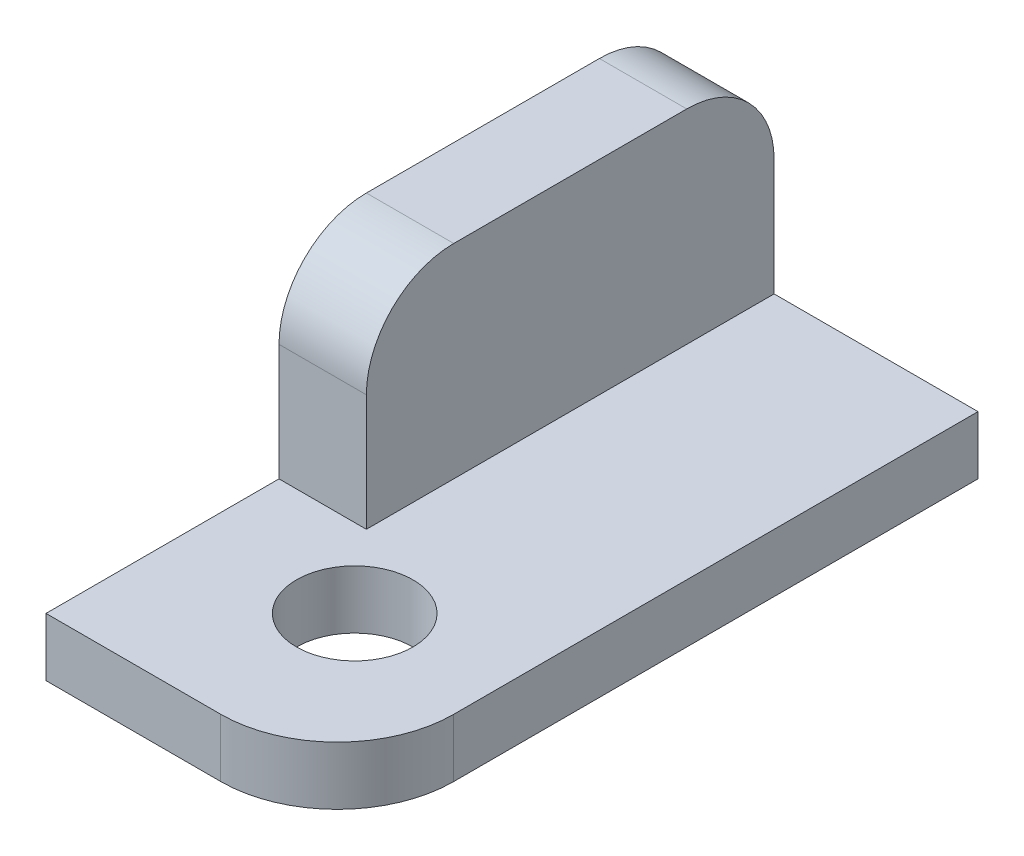
ISO-10303-21;
HEADER;
FILE_DESCRIPTION(('STEP AP214'),'2;1');
FILE_NAME('part.step','',(''),(''),'','','');
FILE_SCHEMA(('AUTOMOTIVE_DESIGN { 1 0 10303 214 1 1 1 1 }'));
ENDSEC;
DATA;
#1=APPLICATION_CONTEXT('core data for automotive mechanical design processes');
#2=APPLICATION_PROTOCOL_DEFINITION('international standard','automotive_design',2000,#1);
#3=PRODUCT_CONTEXT('',#1,'mechanical');
#4=PRODUCT('Part','Part','',(#3));
#5=PRODUCT_RELATED_PRODUCT_CATEGORY('part','',(#4));
#6=PRODUCT_DEFINITION_FORMATION('','',#4);
#7=PRODUCT_DEFINITION_CONTEXT('part definition',#1,'design');
#8=PRODUCT_DEFINITION('design','',#6,#7);
#9=PRODUCT_DEFINITION_SHAPE('','',#8);
#10=(LENGTH_UNIT() NAMED_UNIT(*) SI_UNIT(.MILLI.,.METRE.));
#11=(NAMED_UNIT(*) PLANE_ANGLE_UNIT() SI_UNIT($,.RADIAN.));
#12=(NAMED_UNIT(*) SI_UNIT($,.STERADIAN.) SOLID_ANGLE_UNIT());
#13=UNCERTAINTY_MEASURE_WITH_UNIT(LENGTH_MEASURE(1.E-05),#10,'distance_accuracy_value','');
#14=(GEOMETRIC_REPRESENTATION_CONTEXT(3) GLOBAL_UNCERTAINTY_ASSIGNED_CONTEXT((#13)) GLOBAL_UNIT_ASSIGNED_CONTEXT((#10,
#11,#12)) REPRESENTATION_CONTEXT('',''));
#15=CARTESIAN_POINT('',(0.,0.,0.));
#16=DIRECTION('',(0.,0.,1.));
#17=DIRECTION('',(1.,0.,0.));
#18=AXIS2_PLACEMENT_3D('',#15,#16,#17);
#19=CARTESIAN_POINT('',(50.,0.,0.));
#20=DIRECTION('',(0.,0.,-1.));
#21=DIRECTION('',(0.,1.,0.));
#22=AXIS2_PLACEMENT_3D('',#19,#20,#21);
#23=PLANE('',#22);
#24=DIRECTION('',(-1.,0.,0.));
#25=VECTOR('',#24,1.);
#26=CARTESIAN_POINT('',(50.,-10.,0.));
#27=LINE('',#26,#25);
#28=CARTESIAN_POINT('',(30.,-10.,0.));
#29=VERTEX_POINT('',#28);
#30=CARTESIAN_POINT('',(0.,-10.,0.));
#31=VERTEX_POINT('',#30);
#32=EDGE_CURVE('E140',#29,#31,#27,.T.);
#33=ORIENTED_EDGE('',*,*,#32,.F.);
#34=DIRECTION('',(0.,-1.,0.));
#35=VECTOR('',#34,1.);
#36=CARTESIAN_POINT('',(30.,0.,0.));
#37=LINE('',#36,#35);
#38=CARTESIAN_POINT('',(30.,0.,0.));
#39=VERTEX_POINT('',#38);
#40=EDGE_CURVE('E41',#29,#39,#37,.F.);
#41=ORIENTED_EDGE('',*,*,#40,.T.);
#42=DIRECTION('',(-1.,0.,0.));
#43=VECTOR('',#42,1.);
#44=CARTESIAN_POINT('',(50.,0.,0.));
#45=LINE('',#44,#43);
#46=CARTESIAN_POINT('',(0.,0.,0.));
#47=VERTEX_POINT('',#46);
#48=EDGE_CURVE('E137',#39,#47,#45,.T.);
#49=ORIENTED_EDGE('',*,*,#48,.T.);
#50=DIRECTION('',(0.,-1.,0.));
#51=VECTOR('',#50,1.);
#52=CARTESIAN_POINT('',(0.,0.,0.));
#53=LINE('',#52,#51);
#54=EDGE_CURVE('E186',#47,#31,#53,.T.);
#55=ORIENTED_EDGE('',*,*,#54,.T.);
#56=EDGE_LOOP('',(#33,#41,#49,#55));
#57=FACE_BOUND('',#56,.T.);
#58=ADVANCED_FACE('F33',(#57),#23,.F.);
#59=CARTESIAN_POINT('',(50.,-10.,0.));
#60=DIRECTION('',(0.,1.,0.));
#61=DIRECTION('',(0.,0.,1.));
#62=AXIS2_PLACEMENT_3D('',#59,#60,#61);
#63=PLANE('',#62);
#64=CARTESIAN_POINT('',(26.5,-10.,-26.5));
#65=DIRECTION('',(0.,1.,0.));
#66=DIRECTION('',(0.,0.,1.));
#67=AXIS2_PLACEMENT_3D('',#64,#65,#66);
#68=CIRCLE('',#67,10.);
#69=CARTESIAN_POINT('',(26.5,-10.,-16.5));
#70=VERTEX_POINT('',#69);
#71=EDGE_CURVE('E121',#70,#70,#68,.T.);
#72=ORIENTED_EDGE('',*,*,#71,.T.);
#73=EDGE_LOOP('',(#72));
#74=FACE_BOUND('',#73,.T.);
#75=DIRECTION('',(0.,0.,-1.));
#76=VECTOR('',#75,1.);
#77=CARTESIAN_POINT('',(50.,-10.,0.));
#78=LINE('',#77,#76);
#79=CARTESIAN_POINT('',(50.,-10.,-20.));
#80=VERTEX_POINT('',#79);
#81=CARTESIAN_POINT('',(50.,-10.,-110.));
#82=VERTEX_POINT('',#81);
#83=EDGE_CURVE('E171',#80,#82,#78,.T.);
#84=ORIENTED_EDGE('',*,*,#83,.F.);
#85=CARTESIAN_POINT('',(30.,-10.,-20.));
#86=DIRECTION('',(0.,1.,0.));
#87=DIRECTION('',(0.,0.,1.));
#88=AXIS2_PLACEMENT_3D('',#85,#86,#87);
#89=CIRCLE('',#88,20.);
#90=EDGE_CURVE('E55',#80,#29,#89,.F.);
#91=ORIENTED_EDGE('',*,*,#90,.T.);
#92=ORIENTED_EDGE('',*,*,#32,.T.);
#93=DIRECTION('',(0.,0.,-1.));
#94=VECTOR('',#93,1.);
#95=CARTESIAN_POINT('',(0.,-10.,0.));
#96=LINE('',#95,#94);
#97=CARTESIAN_POINT('',(0.,-10.,-110.));
#98=VERTEX_POINT('',#97);
#99=EDGE_CURVE('E189',#31,#98,#96,.T.);
#100=ORIENTED_EDGE('',*,*,#99,.T.);
#101=DIRECTION('',(-1.,0.,0.));
#102=VECTOR('',#101,1.);
#103=CARTESIAN_POINT('',(50.,-10.,-110.));
#104=LINE('',#103,#102);
#105=EDGE_CURVE('E136',#82,#98,#104,.T.);
#106=ORIENTED_EDGE('',*,*,#105,.F.);
#107=EDGE_LOOP('',(#84,#91,#92,#100,#106));
#108=FACE_BOUND('',#107,.T.);
#109=ADVANCED_FACE('F175',(#74,#108),#63,.F.);
#110=CARTESIAN_POINT('',(50.,-10.,-110.));
#111=DIRECTION('',(0.,0.,1.));
#112=DIRECTION('',(1.,0.,0.));
#113=AXIS2_PLACEMENT_3D('',#110,#111,#112);
#114=PLANE('',#113);
#115=DIRECTION('',(0.,1.,0.));
#116=VECTOR('',#115,1.);
#117=CARTESIAN_POINT('',(0.,-10.,-110.));
#118=LINE('',#117,#116);
#119=CARTESIAN_POINT('',(0.,20.,-110.));
#120=VERTEX_POINT('',#119);
#121=EDGE_CURVE('E191',#98,#120,#118,.T.);
#122=ORIENTED_EDGE('',*,*,#121,.T.);
#123=DIRECTION('',(-1.,0.,0.));
#124=VECTOR('',#123,1.);
#125=CARTESIAN_POINT('',(50.,20.,-110.));
#126=LINE('',#125,#124);
#127=CARTESIAN_POINT('',(15.,20.,-110.));
#128=VERTEX_POINT('',#127);
#129=EDGE_CURVE('E156',#120,#128,#126,.F.);
#130=ORIENTED_EDGE('',*,*,#129,.T.);
#131=DIRECTION('',(0.,-1.,0.));
#132=VECTOR('',#131,1.);
#133=CARTESIAN_POINT('',(15.,-10.,-110.));
#134=LINE('',#133,#132);
#135=CARTESIAN_POINT('',(15.,0.,-110.));
#136=VERTEX_POINT('',#135);
#137=EDGE_CURVE('E182',#128,#136,#134,.T.);
#138=ORIENTED_EDGE('',*,*,#137,.T.);
#139=DIRECTION('',(1.,0.,0.));
#140=VECTOR('',#139,1.);
#141=CARTESIAN_POINT('',(50.,0.,-110.));
#142=LINE('',#141,#140);
#143=CARTESIAN_POINT('',(50.,0.,-110.));
#144=VERTEX_POINT('',#143);
#145=EDGE_CURVE('E131',#136,#144,#142,.T.);
#146=ORIENTED_EDGE('',*,*,#145,.T.);
#147=DIRECTION('',(0.,1.,0.));
#148=VECTOR('',#147,1.);
#149=CARTESIAN_POINT('',(50.,-10.,-110.));
#150=LINE('',#149,#148);
#151=EDGE_CURVE('E177',#82,#144,#150,.T.);
#152=ORIENTED_EDGE('',*,*,#151,.F.);
#153=ORIENTED_EDGE('',*,*,#105,.T.);
#154=EDGE_LOOP('',(#122,#130,#138,#146,#152,#153));
#155=FACE_BOUND('',#154,.T.);
#156=ADVANCED_FACE('F221',(#155),#114,.F.);
#157=CARTESIAN_POINT('',(50.,35.,-110.));
#158=DIRECTION('',(0.,-1.,0.));
#159=DIRECTION('',(0.,0.,-1.));
#160=AXIS2_PLACEMENT_3D('',#157,#158,#159);
#161=PLANE('',#160);
#162=DIRECTION('',(0.,0.,1.));
#163=VECTOR('',#162,1.);
#164=CARTESIAN_POINT('',(15.,35.,-156.));
#165=LINE('',#164,#163);
#166=CARTESIAN_POINT('',(15.,35.,-95.));
#167=VERTEX_POINT('',#166);
#168=CARTESIAN_POINT('',(15.,35.,-55.));
#169=VERTEX_POINT('',#168);
#170=EDGE_CURVE('E120',#167,#169,#165,.T.);
#171=ORIENTED_EDGE('',*,*,#170,.F.);
#172=DIRECTION('',(-1.,0.,0.));
#173=VECTOR('',#172,1.);
#174=CARTESIAN_POINT('',(50.,35.,-95.));
#175=LINE('',#174,#173);
#176=CARTESIAN_POINT('',(0.,35.,-95.));
#177=VERTEX_POINT('',#176);
#178=EDGE_CURVE('E149',#167,#177,#175,.T.);
#179=ORIENTED_EDGE('',*,*,#178,.T.);
#180=DIRECTION('',(0.,0.,1.));
#181=VECTOR('',#180,1.);
#182=CARTESIAN_POINT('',(0.,35.,-110.));
#183=LINE('',#182,#181);
#184=CARTESIAN_POINT('',(0.,35.,-55.));
#185=VERTEX_POINT('',#184);
#186=EDGE_CURVE('E194',#177,#185,#183,.T.);
#187=ORIENTED_EDGE('',*,*,#186,.T.);
#188=DIRECTION('',(-1.,0.,0.));
#189=VECTOR('',#188,1.);
#190=CARTESIAN_POINT('',(50.,35.,-55.));
#191=LINE('',#190,#189);
#192=EDGE_CURVE('E147',#185,#169,#191,.F.);
#193=ORIENTED_EDGE('',*,*,#192,.T.);
#194=EDGE_LOOP('',(#171,#179,#187,#193));
#195=FACE_BOUND('',#194,.T.);
#196=ADVANCED_FACE('F201',(#195),#161,.F.);
#197=CARTESIAN_POINT('',(50.,35.,-40.));
#198=DIRECTION('',(0.,0.,-1.));
#199=DIRECTION('',(0.,1.,0.));
#200=AXIS2_PLACEMENT_3D('',#197,#198,#199);
#201=PLANE('',#200);
#202=DIRECTION('',(0.,-1.,0.));
#203=VECTOR('',#202,1.);
#204=CARTESIAN_POINT('',(15.,0.,-40.));
#205=LINE('',#204,#203);
#206=CARTESIAN_POINT('',(15.,20.,-40.));
#207=VERTEX_POINT('',#206);
#208=CARTESIAN_POINT('',(15.,0.,-40.));
#209=VERTEX_POINT('',#208);
#210=EDGE_CURVE('E108',#207,#209,#205,.T.);
#211=ORIENTED_EDGE('',*,*,#210,.F.);
#212=DIRECTION('',(-1.,0.,0.));
#213=VECTOR('',#212,1.);
#214=CARTESIAN_POINT('',(50.,20.,-40.));
#215=LINE('',#214,#213);
#216=CARTESIAN_POINT('',(0.,20.,-40.));
#217=VERTEX_POINT('',#216);
#218=EDGE_CURVE('E161',#207,#217,#215,.T.);
#219=ORIENTED_EDGE('',*,*,#218,.T.);
#220=DIRECTION('',(0.,-1.,0.));
#221=VECTOR('',#220,1.);
#222=CARTESIAN_POINT('',(0.,35.,-40.));
#223=LINE('',#222,#221);
#224=CARTESIAN_POINT('',(0.,0.,-40.));
#225=VERTEX_POINT('',#224);
#226=EDGE_CURVE('E135',#217,#225,#223,.T.);
#227=ORIENTED_EDGE('',*,*,#226,.T.);
#228=DIRECTION('',(-1.,0.,0.));
#229=VECTOR('',#228,1.);
#230=CARTESIAN_POINT('',(50.,0.,-40.));
#231=LINE('',#230,#229);
#232=EDGE_CURVE('E128',#209,#225,#231,.T.);
#233=ORIENTED_EDGE('',*,*,#232,.F.);
#234=EDGE_LOOP('',(#211,#219,#227,#233));
#235=FACE_BOUND('',#234,.T.);
#236=ADVANCED_FACE('F133',(#235),#201,.F.);
#237=CARTESIAN_POINT('',(50.,0.,0.));
#238=DIRECTION('',(0.,-1.,0.));
#239=DIRECTION('',(0.,0.,-1.));
#240=AXIS2_PLACEMENT_3D('',#237,#238,#239);
#241=PLANE('',#240);
#242=CARTESIAN_POINT('',(26.5,0.,-26.5));
#243=DIRECTION('',(0.,1.,0.));
#244=DIRECTION('',(0.,0.,1.));
#245=AXIS2_PLACEMENT_3D('',#242,#243,#244);
#246=CIRCLE('',#245,10.);
#247=CARTESIAN_POINT('',(26.5,0.,-16.5));
#248=VERTEX_POINT('',#247);
#249=EDGE_CURVE('E309',#248,#248,#246,.T.);
#250=ORIENTED_EDGE('',*,*,#249,.F.);
#251=EDGE_LOOP('',(#250));
#252=FACE_BOUND('',#251,.T.);
#253=ORIENTED_EDGE('',*,*,#48,.F.);
#254=CARTESIAN_POINT('',(30.,0.,-20.));
#255=DIRECTION('',(0.,-1.,0.));
#256=DIRECTION('',(0.,0.,-1.));
#257=AXIS2_PLACEMENT_3D('',#254,#255,#256);
#258=CIRCLE('',#257,20.);
#259=CARTESIAN_POINT('',(50.,0.,-20.));
#260=VERTEX_POINT('',#259);
#261=EDGE_CURVE('E11',#39,#260,#258,.F.);
#262=ORIENTED_EDGE('',*,*,#261,.T.);
#263=DIRECTION('',(0.,0.,1.));
#264=VECTOR('',#263,1.);
#265=CARTESIAN_POINT('',(50.,0.,0.));
#266=LINE('',#265,#264);
#267=EDGE_CURVE('E142',#144,#260,#266,.T.);
#268=ORIENTED_EDGE('',*,*,#267,.F.);
#269=ORIENTED_EDGE('',*,*,#145,.F.);
#270=DIRECTION('',(0.,0.,1.));
#271=VECTOR('',#270,1.);
#272=CARTESIAN_POINT('',(15.,0.,-156.));
#273=LINE('',#272,#271);
#274=EDGE_CURVE('E112',#136,#209,#273,.T.);
#275=ORIENTED_EDGE('',*,*,#274,.T.);
#276=ORIENTED_EDGE('',*,*,#232,.T.);
#277=DIRECTION('',(0.,0.,1.));
#278=VECTOR('',#277,1.);
#279=CARTESIAN_POINT('',(0.,0.,0.));
#280=LINE('',#279,#278);
#281=EDGE_CURVE('E178',#225,#47,#280,.T.);
#282=ORIENTED_EDGE('',*,*,#281,.T.);
#283=EDGE_LOOP('',(#253,#262,#268,#269,#275,#276,#282));
#284=FACE_BOUND('',#283,.T.);
#285=ADVANCED_FACE('F126',(#252,#284),#241,.F.);
#286=CARTESIAN_POINT('',(50.,0.,0.));
#287=DIRECTION('',(1.,0.,0.));
#288=DIRECTION('',(0.,0.,-1.));
#289=AXIS2_PLACEMENT_3D('',#286,#287,#288);
#290=PLANE('',#289);
#291=ORIENTED_EDGE('',*,*,#267,.T.);
#292=DIRECTION('',(0.,-1.,0.));
#293=VECTOR('',#292,1.);
#294=CARTESIAN_POINT('',(50.,-10.,-20.));
#295=LINE('',#294,#293);
#296=EDGE_CURVE('E163',#260,#80,#295,.T.);
#297=ORIENTED_EDGE('',*,*,#296,.T.);
#298=ORIENTED_EDGE('',*,*,#83,.T.);
#299=ORIENTED_EDGE('',*,*,#151,.T.);
#300=EDGE_LOOP('',(#291,#297,#298,#299));
#301=FACE_BOUND('',#300,.T.);
#302=ADVANCED_FACE('F169',(#301),#290,.T.);
#303=CARTESIAN_POINT('',(0.,0.,0.));
#304=DIRECTION('',(1.,0.,0.));
#305=DIRECTION('',(0.,0.,-1.));
#306=AXIS2_PLACEMENT_3D('',#303,#304,#305);
#307=PLANE('',#306);
#308=ORIENTED_EDGE('',*,*,#186,.F.);
#309=CARTESIAN_POINT('',(0.,20.,-95.));
#310=DIRECTION('',(1.,0.,0.));
#311=DIRECTION('',(0.,0.,-1.));
#312=AXIS2_PLACEMENT_3D('',#309,#310,#311);
#313=CIRCLE('',#312,15.);
#314=EDGE_CURVE('E154',#177,#120,#313,.F.);
#315=ORIENTED_EDGE('',*,*,#314,.T.);
#316=ORIENTED_EDGE('',*,*,#121,.F.);
#317=ORIENTED_EDGE('',*,*,#99,.F.);
#318=ORIENTED_EDGE('',*,*,#54,.F.);
#319=ORIENTED_EDGE('',*,*,#281,.F.);
#320=ORIENTED_EDGE('',*,*,#226,.F.);
#321=CARTESIAN_POINT('',(0.,20.,-55.));
#322=DIRECTION('',(1.,0.,0.));
#323=DIRECTION('',(0.,0.,-1.));
#324=AXIS2_PLACEMENT_3D('',#321,#322,#323);
#325=CIRCLE('',#324,15.);
#326=EDGE_CURVE('E152',#217,#185,#325,.F.);
#327=ORIENTED_EDGE('',*,*,#326,.T.);
#328=EDGE_LOOP('',(#308,#315,#316,#317,#318,#319,#320,#327));
#329=FACE_BOUND('',#328,.T.);
#330=ADVANCED_FACE('F206',(#329),#307,.F.);
#331=CARTESIAN_POINT('',(15.,0.,-156.));
#332=DIRECTION('',(-1.,0.,0.));
#333=DIRECTION('',(0.,0.,1.));
#334=AXIS2_PLACEMENT_3D('',#331,#332,#333);
#335=PLANE('',#334);
#336=ORIENTED_EDGE('',*,*,#137,.F.);
#337=CARTESIAN_POINT('',(15.,20.,-95.));
#338=DIRECTION('',(-1.,0.,0.));
#339=DIRECTION('',(0.,0.,1.));
#340=AXIS2_PLACEMENT_3D('',#337,#338,#339);
#341=CIRCLE('',#340,15.);
#342=EDGE_CURVE('E159',#128,#167,#341,.F.);
#343=ORIENTED_EDGE('',*,*,#342,.T.);
#344=ORIENTED_EDGE('',*,*,#170,.T.);
#345=CARTESIAN_POINT('',(15.,20.,-55.));
#346=DIRECTION('',(-1.,0.,0.));
#347=DIRECTION('',(0.,0.,1.));
#348=AXIS2_PLACEMENT_3D('',#345,#346,#347);
#349=CIRCLE('',#348,15.);
#350=EDGE_CURVE('E115',#169,#207,#349,.F.);
#351=ORIENTED_EDGE('',*,*,#350,.T.);
#352=ORIENTED_EDGE('',*,*,#210,.T.);
#353=ORIENTED_EDGE('',*,*,#274,.F.);
#354=EDGE_LOOP('',(#336,#343,#344,#351,#352,#353));
#355=FACE_BOUND('',#354,.T.);
#356=ADVANCED_FACE('F111',(#355),#335,.F.);
#357=CARTESIAN_POINT('',(50.,20.,-95.));
#358=DIRECTION('',(-1.,0.,0.));
#359=DIRECTION('',(0.,0.,1.));
#360=AXIS2_PLACEMENT_3D('',#357,#358,#359);
#361=CYLINDRICAL_SURFACE('',#360,15.);
#362=ORIENTED_EDGE('',*,*,#342,.F.);
#363=ORIENTED_EDGE('',*,*,#129,.F.);
#364=ORIENTED_EDGE('',*,*,#314,.F.);
#365=ORIENTED_EDGE('',*,*,#178,.F.);
#366=EDGE_LOOP('',(#362,#363,#364,#365));
#367=FACE_BOUND('',#366,.T.);
#368=ADVANCED_FACE('F226',(#367),#361,.T.);
#369=CARTESIAN_POINT('',(50.,20.,-55.));
#370=DIRECTION('',(-1.,0.,0.));
#371=DIRECTION('',(0.,0.,1.));
#372=AXIS2_PLACEMENT_3D('',#369,#370,#371);
#373=CYLINDRICAL_SURFACE('',#372,15.);
#374=ORIENTED_EDGE('',*,*,#350,.F.);
#375=ORIENTED_EDGE('',*,*,#192,.F.);
#376=ORIENTED_EDGE('',*,*,#326,.F.);
#377=ORIENTED_EDGE('',*,*,#218,.F.);
#378=EDGE_LOOP('',(#374,#375,#376,#377));
#379=FACE_BOUND('',#378,.T.);
#380=ADVANCED_FACE('F205',(#379),#373,.T.);
#381=CARTESIAN_POINT('',(26.5,-10.,-26.5));
#382=DIRECTION('',(0.,1.,0.));
#383=DIRECTION('',(0.,0.,1.));
#384=AXIS2_PLACEMENT_3D('',#381,#382,#383);
#385=CYLINDRICAL_SURFACE('',#384,10.);
#386=ORIENTED_EDGE('',*,*,#71,.F.);
#387=EDGE_LOOP('',(#386));
#388=FACE_BOUND('',#387,.T.);
#389=ORIENTED_EDGE('',*,*,#249,.T.);
#390=EDGE_LOOP('',(#389));
#391=FACE_BOUND('',#390,.T.);
#392=ADVANCED_FACE('F210',(#388,#391),#385,.F.);
#393=CARTESIAN_POINT('',(30.,0.,-20.));
#394=DIRECTION('',(0.,1.,0.));
#395=DIRECTION('',(0.,0.,1.));
#396=AXIS2_PLACEMENT_3D('',#393,#394,#395);
#397=CYLINDRICAL_SURFACE('',#396,20.);
#398=ORIENTED_EDGE('',*,*,#261,.F.);
#399=ORIENTED_EDGE('',*,*,#40,.F.);
#400=ORIENTED_EDGE('',*,*,#90,.F.);
#401=ORIENTED_EDGE('',*,*,#296,.F.);
#402=EDGE_LOOP('',(#398,#399,#400,#401));
#403=FACE_BOUND('',#402,.T.);
#404=ADVANCED_FACE('F35',(#403),#397,.T.);
#405=CLOSED_SHELL('',(#58,#109,#156,#196,#236,#285,#302,#330,#356,#368,#380,#392,#404));
#406=MANIFOLD_SOLID_BREP('B2',#405);
#407=ADVANCED_BREP_SHAPE_REPRESENTATION('',(#18,#406),#14);
#408=SHAPE_DEFINITION_REPRESENTATION(#9,#407);
ENDSEC;
END-ISO-10303-21;
